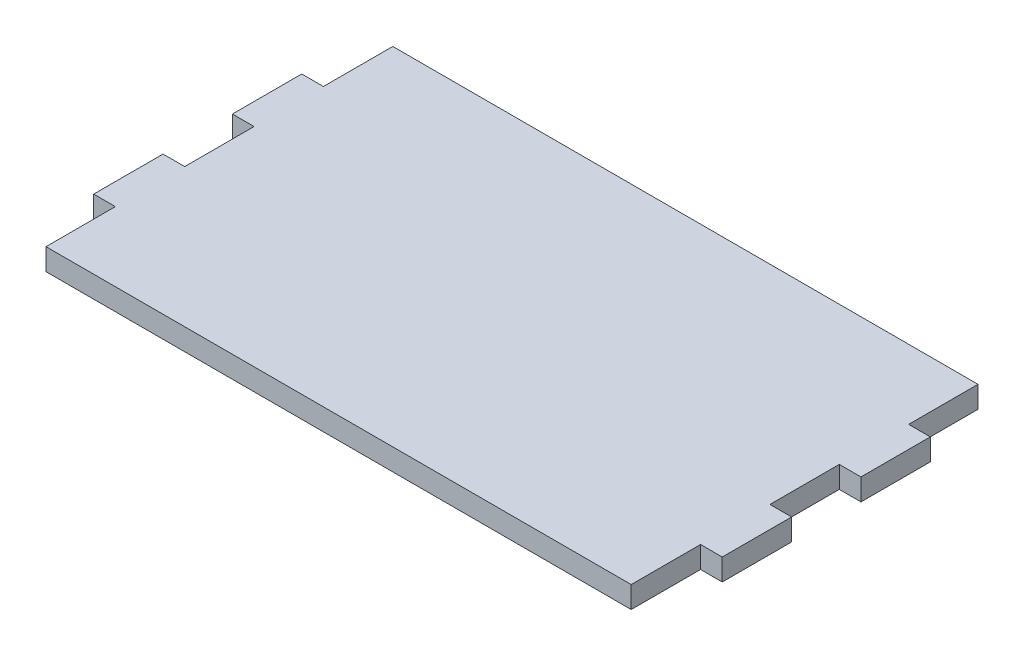
ISO-10303-21;
HEADER;
FILE_DESCRIPTION(('STEP AP214'),'2;1');
FILE_NAME('part.step','',(''),(''),'','','');
FILE_SCHEMA(('AUTOMOTIVE_DESIGN { 1 0 10303 214 1 1 1 1 }'));
ENDSEC;
DATA;
#1=APPLICATION_CONTEXT('core data for automotive mechanical design processes');
#2=APPLICATION_PROTOCOL_DEFINITION('international standard','automotive_design',2000,#1);
#3=PRODUCT_CONTEXT('',#1,'mechanical');
#4=PRODUCT('Part','Part','',(#3));
#5=PRODUCT_RELATED_PRODUCT_CATEGORY('part','',(#4));
#6=PRODUCT_DEFINITION_FORMATION('','',#4);
#7=PRODUCT_DEFINITION_CONTEXT('part definition',#1,'design');
#8=PRODUCT_DEFINITION('design','',#6,#7);
#9=PRODUCT_DEFINITION_SHAPE('','',#8);
#10=(LENGTH_UNIT() NAMED_UNIT(*) SI_UNIT(.MILLI.,.METRE.));
#11=(NAMED_UNIT(*) PLANE_ANGLE_UNIT() SI_UNIT($,.RADIAN.));
#12=(NAMED_UNIT(*) SI_UNIT($,.STERADIAN.) SOLID_ANGLE_UNIT());
#13=UNCERTAINTY_MEASURE_WITH_UNIT(LENGTH_MEASURE(1.E-05),#10,'distance_accuracy_value','');
#14=(GEOMETRIC_REPRESENTATION_CONTEXT(3) GLOBAL_UNCERTAINTY_ASSIGNED_CONTEXT((#13)) GLOBAL_UNIT_ASSIGNED_CONTEXT((#10,
#11,#12)) REPRESENTATION_CONTEXT('',''));
#15=CARTESIAN_POINT('',(0.,0.,0.));
#16=DIRECTION('',(0.,0.,1.));
#17=DIRECTION('',(1.,0.,0.));
#18=AXIS2_PLACEMENT_3D('',#15,#16,#17);
#19=CARTESIAN_POINT('',(-67.5,5.,-40.));
#20=DIRECTION('',(0.,0.,1.));
#21=DIRECTION('',(1.,0.,0.));
#22=AXIS2_PLACEMENT_3D('',#19,#20,#21);
#23=PLANE('',#22);
#24=DIRECTION('',(-1.,0.,0.));
#25=VECTOR('',#24,1.);
#26=CARTESIAN_POINT('',(-67.5,0.,-40.));
#27=LINE('',#26,#25);
#28=CARTESIAN_POINT('',(67.5,0.,-40.));
#29=VERTEX_POINT('',#28);
#30=CARTESIAN_POINT('',(-67.5,0.,-40.));
#31=VERTEX_POINT('',#30);
#32=EDGE_CURVE('E203',#29,#31,#27,.T.);
#33=ORIENTED_EDGE('',*,*,#32,.T.);
#34=DIRECTION('',(0.,-1.,0.));
#35=VECTOR('',#34,1.);
#36=CARTESIAN_POINT('',(-67.5,5.,-40.));
#37=LINE('',#36,#35);
#38=CARTESIAN_POINT('',(-67.5,5.,-40.));
#39=VERTEX_POINT('',#38);
#40=EDGE_CURVE('E11',#39,#31,#37,.T.);
#41=ORIENTED_EDGE('',*,*,#40,.F.);
#42=DIRECTION('',(-1.,0.,0.));
#43=VECTOR('',#42,1.);
#44=CARTESIAN_POINT('',(-67.5,5.,-40.));
#45=LINE('',#44,#43);
#46=CARTESIAN_POINT('',(67.5,5.,-40.));
#47=VERTEX_POINT('',#46);
#48=EDGE_CURVE('E241',#47,#39,#45,.T.);
#49=ORIENTED_EDGE('',*,*,#48,.F.);
#50=DIRECTION('',(0.,-1.,0.));
#51=VECTOR('',#50,1.);
#52=CARTESIAN_POINT('',(67.5,5.,-40.));
#53=LINE('',#52,#51);
#54=EDGE_CURVE('E199',#47,#29,#53,.T.);
#55=ORIENTED_EDGE('',*,*,#54,.T.);
#56=EDGE_LOOP('',(#33,#41,#49,#55));
#57=FACE_BOUND('',#56,.T.);
#58=ADVANCED_FACE('F35',(#57),#23,.F.);
#59=CARTESIAN_POINT('',(-67.5,5.,-40.));
#60=DIRECTION('',(1.,0.,0.));
#61=DIRECTION('',(0.,0.,-1.));
#62=AXIS2_PLACEMENT_3D('',#59,#60,#61);
#63=PLANE('',#62);
#64=DIRECTION('',(0.,0.,1.));
#65=VECTOR('',#64,1.);
#66=CARTESIAN_POINT('',(-67.5,0.,-40.));
#67=LINE('',#66,#65);
#68=CARTESIAN_POINT('',(-67.5,0.,-24.));
#69=VERTEX_POINT('',#68);
#70=EDGE_CURVE('E206',#31,#69,#67,.T.);
#71=ORIENTED_EDGE('',*,*,#70,.T.);
#72=DIRECTION('',(0.,-1.,0.));
#73=VECTOR('',#72,1.);
#74=CARTESIAN_POINT('',(-67.5,5.,-24.));
#75=LINE('',#74,#73);
#76=CARTESIAN_POINT('',(-67.5,5.,-24.));
#77=VERTEX_POINT('',#76);
#78=EDGE_CURVE('E43',#77,#69,#75,.T.);
#79=ORIENTED_EDGE('',*,*,#78,.F.);
#80=DIRECTION('',(0.,0.,1.));
#81=VECTOR('',#80,1.);
#82=CARTESIAN_POINT('',(-67.5,5.,-40.));
#83=LINE('',#82,#81);
#84=EDGE_CURVE('E130',#39,#77,#83,.T.);
#85=ORIENTED_EDGE('',*,*,#84,.F.);
#86=ORIENTED_EDGE('',*,*,#40,.T.);
#87=EDGE_LOOP('',(#71,#79,#85,#86));
#88=FACE_BOUND('',#87,.T.);
#89=ADVANCED_FACE('F359',(#88),#63,.F.);
#90=CARTESIAN_POINT('',(-72.5,5.,-24.));
#91=DIRECTION('',(0.,0.,1.));
#92=DIRECTION('',(1.,0.,0.));
#93=AXIS2_PLACEMENT_3D('',#90,#91,#92);
#94=PLANE('',#93);
#95=DIRECTION('',(-1.,0.,0.));
#96=VECTOR('',#95,1.);
#97=CARTESIAN_POINT('',(-72.5,0.,-24.));
#98=LINE('',#97,#96);
#99=CARTESIAN_POINT('',(-72.5,0.,-24.));
#100=VERTEX_POINT('',#99);
#101=EDGE_CURVE('E208',#69,#100,#98,.T.);
#102=ORIENTED_EDGE('',*,*,#101,.T.);
#103=DIRECTION('',(0.,-1.,0.));
#104=VECTOR('',#103,1.);
#105=CARTESIAN_POINT('',(-72.5,5.,-24.));
#106=LINE('',#105,#104);
#107=CARTESIAN_POINT('',(-72.5,5.,-24.));
#108=VERTEX_POINT('',#107);
#109=EDGE_CURVE('E284',#108,#100,#106,.T.);
#110=ORIENTED_EDGE('',*,*,#109,.F.);
#111=DIRECTION('',(-1.,0.,0.));
#112=VECTOR('',#111,1.);
#113=CARTESIAN_POINT('',(-72.5,5.,-24.));
#114=LINE('',#113,#112);
#115=EDGE_CURVE('E292',#77,#108,#114,.T.);
#116=ORIENTED_EDGE('',*,*,#115,.F.);
#117=ORIENTED_EDGE('',*,*,#78,.T.);
#118=EDGE_LOOP('',(#102,#110,#116,#117));
#119=FACE_BOUND('',#118,.T.);
#120=ADVANCED_FACE('F290',(#119),#94,.F.);
#121=CARTESIAN_POINT('',(-72.5,5.,-24.));
#122=DIRECTION('',(1.,0.,0.));
#123=DIRECTION('',(0.,0.,-1.));
#124=AXIS2_PLACEMENT_3D('',#121,#122,#123);
#125=PLANE('',#124);
#126=DIRECTION('',(0.,0.,1.));
#127=VECTOR('',#126,1.);
#128=CARTESIAN_POINT('',(-72.5,0.,-24.));
#129=LINE('',#128,#127);
#130=CARTESIAN_POINT('',(-72.5,0.,-8.));
#131=VERTEX_POINT('',#130);
#132=EDGE_CURVE('E210',#100,#131,#129,.T.);
#133=ORIENTED_EDGE('',*,*,#132,.T.);
#134=DIRECTION('',(0.,-1.,0.));
#135=VECTOR('',#134,1.);
#136=CARTESIAN_POINT('',(-72.5,5.,-8.));
#137=LINE('',#136,#135);
#138=CARTESIAN_POINT('',(-72.5,5.,-8.));
#139=VERTEX_POINT('',#138);
#140=EDGE_CURVE('E281',#139,#131,#137,.T.);
#141=ORIENTED_EDGE('',*,*,#140,.F.);
#142=DIRECTION('',(0.,0.,1.));
#143=VECTOR('',#142,1.);
#144=CARTESIAN_POINT('',(-72.5,5.,-24.));
#145=LINE('',#144,#143);
#146=EDGE_CURVE('E310',#108,#139,#145,.T.);
#147=ORIENTED_EDGE('',*,*,#146,.F.);
#148=ORIENTED_EDGE('',*,*,#109,.T.);
#149=EDGE_LOOP('',(#133,#141,#147,#148));
#150=FACE_BOUND('',#149,.T.);
#151=ADVANCED_FACE('F301',(#150),#125,.F.);
#152=CARTESIAN_POINT('',(-72.5,5.,-8.));
#153=DIRECTION('',(0.,0.,-1.));
#154=DIRECTION('',(-1.,0.,0.));
#155=AXIS2_PLACEMENT_3D('',#152,#153,#154);
#156=PLANE('',#155);
#157=DIRECTION('',(1.,0.,0.));
#158=VECTOR('',#157,1.);
#159=CARTESIAN_POINT('',(-72.5,0.,-8.));
#160=LINE('',#159,#158);
#161=CARTESIAN_POINT('',(-67.5,0.,-8.));
#162=VERTEX_POINT('',#161);
#163=EDGE_CURVE('E212',#131,#162,#160,.T.);
#164=ORIENTED_EDGE('',*,*,#163,.T.);
#165=DIRECTION('',(0.,-1.,0.));
#166=VECTOR('',#165,1.);
#167=CARTESIAN_POINT('',(-67.5,5.,-8.));
#168=LINE('',#167,#166);
#169=CARTESIAN_POINT('',(-67.5,5.,-8.));
#170=VERTEX_POINT('',#169);
#171=EDGE_CURVE('E278',#170,#162,#168,.T.);
#172=ORIENTED_EDGE('',*,*,#171,.F.);
#173=DIRECTION('',(1.,0.,0.));
#174=VECTOR('',#173,1.);
#175=CARTESIAN_POINT('',(-72.5,5.,-8.));
#176=LINE('',#175,#174);
#177=EDGE_CURVE('E307',#139,#170,#176,.T.);
#178=ORIENTED_EDGE('',*,*,#177,.F.);
#179=ORIENTED_EDGE('',*,*,#140,.T.);
#180=EDGE_LOOP('',(#164,#172,#178,#179));
#181=FACE_BOUND('',#180,.T.);
#182=ADVANCED_FACE('F305',(#181),#156,.F.);
#183=CARTESIAN_POINT('',(-67.5,5.,-8.));
#184=DIRECTION('',(1.,0.,0.));
#185=DIRECTION('',(0.,0.,-1.));
#186=AXIS2_PLACEMENT_3D('',#183,#184,#185);
#187=PLANE('',#186);
#188=DIRECTION('',(0.,0.,1.));
#189=VECTOR('',#188,1.);
#190=CARTESIAN_POINT('',(-67.5,0.,-8.));
#191=LINE('',#190,#189);
#192=CARTESIAN_POINT('',(-67.5,0.,7.99999999999999));
#193=VERTEX_POINT('',#192);
#194=EDGE_CURVE('E214',#162,#193,#191,.T.);
#195=ORIENTED_EDGE('',*,*,#194,.T.);
#196=DIRECTION('',(0.,-1.,0.));
#197=VECTOR('',#196,1.);
#198=CARTESIAN_POINT('',(-67.5,5.,7.99999999999999));
#199=LINE('',#198,#197);
#200=CARTESIAN_POINT('',(-67.5,5.,7.99999999999999));
#201=VERTEX_POINT('',#200);
#202=EDGE_CURVE('E275',#201,#193,#199,.T.);
#203=ORIENTED_EDGE('',*,*,#202,.F.);
#204=DIRECTION('',(0.,0.,1.));
#205=VECTOR('',#204,1.);
#206=CARTESIAN_POINT('',(-67.5,5.,-8.));
#207=LINE('',#206,#205);
#208=EDGE_CURVE('E309',#170,#201,#207,.T.);
#209=ORIENTED_EDGE('',*,*,#208,.F.);
#210=ORIENTED_EDGE('',*,*,#171,.T.);
#211=EDGE_LOOP('',(#195,#203,#209,#210));
#212=FACE_BOUND('',#211,.T.);
#213=ADVANCED_FACE('F372',(#212),#187,.F.);
#214=CARTESIAN_POINT('',(-72.5,5.,7.99999999999999));
#215=DIRECTION('',(0.,0.,1.));
#216=DIRECTION('',(1.,0.,0.));
#217=AXIS2_PLACEMENT_3D('',#214,#215,#216);
#218=PLANE('',#217);
#219=DIRECTION('',(-1.,0.,0.));
#220=VECTOR('',#219,1.);
#221=CARTESIAN_POINT('',(-72.5,0.,7.99999999999999));
#222=LINE('',#221,#220);
#223=CARTESIAN_POINT('',(-72.5,0.,7.99999999999999));
#224=VERTEX_POINT('',#223);
#225=EDGE_CURVE('E216',#193,#224,#222,.T.);
#226=ORIENTED_EDGE('',*,*,#225,.T.);
#227=DIRECTION('',(0.,-1.,0.));
#228=VECTOR('',#227,1.);
#229=CARTESIAN_POINT('',(-72.5,5.,7.99999999999999));
#230=LINE('',#229,#228);
#231=CARTESIAN_POINT('',(-72.5,5.,7.99999999999999));
#232=VERTEX_POINT('',#231);
#233=EDGE_CURVE('E272',#232,#224,#230,.T.);
#234=ORIENTED_EDGE('',*,*,#233,.F.);
#235=DIRECTION('',(-1.,0.,0.));
#236=VECTOR('',#235,1.);
#237=CARTESIAN_POINT('',(-72.5,5.,7.99999999999999));
#238=LINE('',#237,#236);
#239=EDGE_CURVE('E312',#201,#232,#238,.T.);
#240=ORIENTED_EDGE('',*,*,#239,.F.);
#241=ORIENTED_EDGE('',*,*,#202,.T.);
#242=EDGE_LOOP('',(#226,#234,#240,#241));
#243=FACE_BOUND('',#242,.T.);
#244=ADVANCED_FACE('F375',(#243),#218,.F.);
#245=CARTESIAN_POINT('',(-72.5,5.,7.99999999999999));
#246=DIRECTION('',(1.,0.,0.));
#247=DIRECTION('',(0.,0.,-1.));
#248=AXIS2_PLACEMENT_3D('',#245,#246,#247);
#249=PLANE('',#248);
#250=DIRECTION('',(0.,0.,1.));
#251=VECTOR('',#250,1.);
#252=CARTESIAN_POINT('',(-72.5,0.,7.99999999999999));
#253=LINE('',#252,#251);
#254=CARTESIAN_POINT('',(-72.5,0.,24.));
#255=VERTEX_POINT('',#254);
#256=EDGE_CURVE('E218',#224,#255,#253,.T.);
#257=ORIENTED_EDGE('',*,*,#256,.T.);
#258=DIRECTION('',(0.,-1.,0.));
#259=VECTOR('',#258,1.);
#260=CARTESIAN_POINT('',(-72.5,5.,24.));
#261=LINE('',#260,#259);
#262=CARTESIAN_POINT('',(-72.5,5.,24.));
#263=VERTEX_POINT('',#262);
#264=EDGE_CURVE('E269',#263,#255,#261,.T.);
#265=ORIENTED_EDGE('',*,*,#264,.F.);
#266=DIRECTION('',(0.,0.,1.));
#267=VECTOR('',#266,1.);
#268=CARTESIAN_POINT('',(-72.5,5.,7.99999999999999));
#269=LINE('',#268,#267);
#270=EDGE_CURVE('E318',#232,#263,#269,.T.);
#271=ORIENTED_EDGE('',*,*,#270,.F.);
#272=ORIENTED_EDGE('',*,*,#233,.T.);
#273=EDGE_LOOP('',(#257,#265,#271,#272));
#274=FACE_BOUND('',#273,.T.);
#275=ADVANCED_FACE('F379',(#274),#249,.F.);
#276=CARTESIAN_POINT('',(-72.5,5.,24.));
#277=DIRECTION('',(0.,0.,-1.));
#278=DIRECTION('',(-1.,0.,0.));
#279=AXIS2_PLACEMENT_3D('',#276,#277,#278);
#280=PLANE('',#279);
#281=DIRECTION('',(1.,0.,0.));
#282=VECTOR('',#281,1.);
#283=CARTESIAN_POINT('',(-72.5,0.,24.));
#284=LINE('',#283,#282);
#285=CARTESIAN_POINT('',(-67.5,0.,24.));
#286=VERTEX_POINT('',#285);
#287=EDGE_CURVE('E220',#255,#286,#284,.T.);
#288=ORIENTED_EDGE('',*,*,#287,.T.);
#289=DIRECTION('',(0.,-1.,0.));
#290=VECTOR('',#289,1.);
#291=CARTESIAN_POINT('',(-67.5,5.,24.));
#292=LINE('',#291,#290);
#293=CARTESIAN_POINT('',(-67.5,5.,24.));
#294=VERTEX_POINT('',#293);
#295=EDGE_CURVE('E266',#294,#286,#292,.T.);
#296=ORIENTED_EDGE('',*,*,#295,.F.);
#297=DIRECTION('',(1.,0.,0.));
#298=VECTOR('',#297,1.);
#299=CARTESIAN_POINT('',(-72.5,5.,24.));
#300=LINE('',#299,#298);
#301=EDGE_CURVE('E320',#263,#294,#300,.T.);
#302=ORIENTED_EDGE('',*,*,#301,.F.);
#303=ORIENTED_EDGE('',*,*,#264,.T.);
#304=EDGE_LOOP('',(#288,#296,#302,#303));
#305=FACE_BOUND('',#304,.T.);
#306=ADVANCED_FACE('F383',(#305),#280,.F.);
#307=CARTESIAN_POINT('',(-67.5,5.,24.));
#308=DIRECTION('',(1.,0.,0.));
#309=DIRECTION('',(0.,0.,-1.));
#310=AXIS2_PLACEMENT_3D('',#307,#308,#309);
#311=PLANE('',#310);
#312=DIRECTION('',(0.,0.,1.));
#313=VECTOR('',#312,1.);
#314=CARTESIAN_POINT('',(-67.5,0.,24.));
#315=LINE('',#314,#313);
#316=CARTESIAN_POINT('',(-67.5,0.,40.));
#317=VERTEX_POINT('',#316);
#318=EDGE_CURVE('E222',#286,#317,#315,.T.);
#319=ORIENTED_EDGE('',*,*,#318,.T.);
#320=DIRECTION('',(0.,-1.,0.));
#321=VECTOR('',#320,1.);
#322=CARTESIAN_POINT('',(-67.5,5.,40.));
#323=LINE('',#322,#321);
#324=CARTESIAN_POINT('',(-67.5,5.,40.));
#325=VERTEX_POINT('',#324);
#326=EDGE_CURVE('E263',#325,#317,#323,.T.);
#327=ORIENTED_EDGE('',*,*,#326,.F.);
#328=DIRECTION('',(0.,0.,1.));
#329=VECTOR('',#328,1.);
#330=CARTESIAN_POINT('',(-67.5,5.,24.));
#331=LINE('',#330,#329);
#332=EDGE_CURVE('E322',#294,#325,#331,.T.);
#333=ORIENTED_EDGE('',*,*,#332,.F.);
#334=ORIENTED_EDGE('',*,*,#295,.T.);
#335=EDGE_LOOP('',(#319,#327,#333,#334));
#336=FACE_BOUND('',#335,.T.);
#337=ADVANCED_FACE('F387',(#336),#311,.F.);
#338=CARTESIAN_POINT('',(-67.5,5.,40.));
#339=DIRECTION('',(0.,0.,-1.));
#340=DIRECTION('',(-1.,0.,0.));
#341=AXIS2_PLACEMENT_3D('',#338,#339,#340);
#342=PLANE('',#341);
#343=DIRECTION('',(1.,0.,0.));
#344=VECTOR('',#343,1.);
#345=CARTESIAN_POINT('',(-67.5,0.,40.));
#346=LINE('',#345,#344);
#347=CARTESIAN_POINT('',(67.5,0.,40.));
#348=VERTEX_POINT('',#347);
#349=EDGE_CURVE('E224',#317,#348,#346,.T.);
#350=ORIENTED_EDGE('',*,*,#349,.T.);
#351=DIRECTION('',(0.,-1.,0.));
#352=VECTOR('',#351,1.);
#353=CARTESIAN_POINT('',(67.5,5.,40.));
#354=LINE('',#353,#352);
#355=CARTESIAN_POINT('',(67.5,5.,40.));
#356=VERTEX_POINT('',#355);
#357=EDGE_CURVE('E260',#356,#348,#354,.T.);
#358=ORIENTED_EDGE('',*,*,#357,.F.);
#359=DIRECTION('',(1.,0.,0.));
#360=VECTOR('',#359,1.);
#361=CARTESIAN_POINT('',(-67.5,5.,40.));
#362=LINE('',#361,#360);
#363=EDGE_CURVE('E324',#325,#356,#362,.T.);
#364=ORIENTED_EDGE('',*,*,#363,.F.);
#365=ORIENTED_EDGE('',*,*,#326,.T.);
#366=EDGE_LOOP('',(#350,#358,#364,#365));
#367=FACE_BOUND('',#366,.T.);
#368=ADVANCED_FACE('F391',(#367),#342,.F.);
#369=CARTESIAN_POINT('',(67.5,5.,24.));
#370=DIRECTION('',(-1.,0.,0.));
#371=DIRECTION('',(0.,0.,1.));
#372=AXIS2_PLACEMENT_3D('',#369,#370,#371);
#373=PLANE('',#372);
#374=DIRECTION('',(0.,0.,-1.));
#375=VECTOR('',#374,1.);
#376=CARTESIAN_POINT('',(67.5,0.,24.));
#377=LINE('',#376,#375);
#378=CARTESIAN_POINT('',(67.5,0.,24.));
#379=VERTEX_POINT('',#378);
#380=EDGE_CURVE('E226',#348,#379,#377,.T.);
#381=ORIENTED_EDGE('',*,*,#380,.T.);
#382=DIRECTION('',(0.,-1.,0.));
#383=VECTOR('',#382,1.);
#384=CARTESIAN_POINT('',(67.5,5.,24.));
#385=LINE('',#384,#383);
#386=CARTESIAN_POINT('',(67.5,5.,24.));
#387=VERTEX_POINT('',#386);
#388=EDGE_CURVE('E257',#387,#379,#385,.T.);
#389=ORIENTED_EDGE('',*,*,#388,.F.);
#390=DIRECTION('',(0.,0.,-1.));
#391=VECTOR('',#390,1.);
#392=CARTESIAN_POINT('',(67.5,5.,24.));
#393=LINE('',#392,#391);
#394=EDGE_CURVE('E326',#356,#387,#393,.T.);
#395=ORIENTED_EDGE('',*,*,#394,.F.);
#396=ORIENTED_EDGE('',*,*,#357,.T.);
#397=EDGE_LOOP('',(#381,#389,#395,#396));
#398=FACE_BOUND('',#397,.T.);
#399=ADVANCED_FACE('F395',(#398),#373,.F.);
#400=CARTESIAN_POINT('',(67.5,5.,24.));
#401=DIRECTION('',(0.,0.,-1.));
#402=DIRECTION('',(-1.,0.,0.));
#403=AXIS2_PLACEMENT_3D('',#400,#401,#402);
#404=PLANE('',#403);
#405=DIRECTION('',(1.,0.,0.));
#406=VECTOR('',#405,1.);
#407=CARTESIAN_POINT('',(67.5,0.,24.));
#408=LINE('',#407,#406);
#409=CARTESIAN_POINT('',(72.5,0.,24.));
#410=VERTEX_POINT('',#409);
#411=EDGE_CURVE('E228',#379,#410,#408,.T.);
#412=ORIENTED_EDGE('',*,*,#411,.T.);
#413=DIRECTION('',(0.,-1.,0.));
#414=VECTOR('',#413,1.);
#415=CARTESIAN_POINT('',(72.5,5.,24.));
#416=LINE('',#415,#414);
#417=CARTESIAN_POINT('',(72.5,5.,24.));
#418=VERTEX_POINT('',#417);
#419=EDGE_CURVE('E254',#418,#410,#416,.T.);
#420=ORIENTED_EDGE('',*,*,#419,.F.);
#421=DIRECTION('',(1.,0.,0.));
#422=VECTOR('',#421,1.);
#423=CARTESIAN_POINT('',(67.5,5.,24.));
#424=LINE('',#423,#422);
#425=EDGE_CURVE('E328',#387,#418,#424,.T.);
#426=ORIENTED_EDGE('',*,*,#425,.F.);
#427=ORIENTED_EDGE('',*,*,#388,.T.);
#428=EDGE_LOOP('',(#412,#420,#426,#427));
#429=FACE_BOUND('',#428,.T.);
#430=ADVANCED_FACE('F399',(#429),#404,.F.);
#431=CARTESIAN_POINT('',(72.5,5.,7.99999999999999));
#432=DIRECTION('',(-1.,0.,0.));
#433=DIRECTION('',(0.,0.,1.));
#434=AXIS2_PLACEMENT_3D('',#431,#432,#433);
#435=PLANE('',#434);
#436=DIRECTION('',(0.,0.,-1.));
#437=VECTOR('',#436,1.);
#438=CARTESIAN_POINT('',(72.5,0.,7.99999999999999));
#439=LINE('',#438,#437);
#440=CARTESIAN_POINT('',(72.5,0.,7.99999999999999));
#441=VERTEX_POINT('',#440);
#442=EDGE_CURVE('E230',#410,#441,#439,.T.);
#443=ORIENTED_EDGE('',*,*,#442,.T.);
#444=DIRECTION('',(0.,-1.,0.));
#445=VECTOR('',#444,1.);
#446=CARTESIAN_POINT('',(72.5,5.,7.99999999999999));
#447=LINE('',#446,#445);
#448=CARTESIAN_POINT('',(72.5,5.,7.99999999999999));
#449=VERTEX_POINT('',#448);
#450=EDGE_CURVE('E251',#449,#441,#447,.T.);
#451=ORIENTED_EDGE('',*,*,#450,.F.);
#452=DIRECTION('',(0.,0.,-1.));
#453=VECTOR('',#452,1.);
#454=CARTESIAN_POINT('',(72.5,5.,7.99999999999999));
#455=LINE('',#454,#453);
#456=EDGE_CURVE('E330',#418,#449,#455,.T.);
#457=ORIENTED_EDGE('',*,*,#456,.F.);
#458=ORIENTED_EDGE('',*,*,#419,.T.);
#459=EDGE_LOOP('',(#443,#451,#457,#458));
#460=FACE_BOUND('',#459,.T.);
#461=ADVANCED_FACE('F403',(#460),#435,.F.);
#462=CARTESIAN_POINT('',(67.5,5.,7.99999999999999));
#463=DIRECTION('',(0.,0.,1.));
#464=DIRECTION('',(1.,0.,0.));
#465=AXIS2_PLACEMENT_3D('',#462,#463,#464);
#466=PLANE('',#465);
#467=DIRECTION('',(-1.,0.,0.));
#468=VECTOR('',#467,1.);
#469=CARTESIAN_POINT('',(67.5,0.,7.99999999999999));
#470=LINE('',#469,#468);
#471=CARTESIAN_POINT('',(67.5,0.,7.99999999999999));
#472=VERTEX_POINT('',#471);
#473=EDGE_CURVE('E232',#441,#472,#470,.T.);
#474=ORIENTED_EDGE('',*,*,#473,.T.);
#475=DIRECTION('',(0.,-1.,0.));
#476=VECTOR('',#475,1.);
#477=CARTESIAN_POINT('',(67.5,5.,7.99999999999999));
#478=LINE('',#477,#476);
#479=CARTESIAN_POINT('',(67.5,5.,7.99999999999999));
#480=VERTEX_POINT('',#479);
#481=EDGE_CURVE('E248',#480,#472,#478,.T.);
#482=ORIENTED_EDGE('',*,*,#481,.F.);
#483=DIRECTION('',(-1.,0.,0.));
#484=VECTOR('',#483,1.);
#485=CARTESIAN_POINT('',(67.5,5.,7.99999999999999));
#486=LINE('',#485,#484);
#487=EDGE_CURVE('E332',#449,#480,#486,.T.);
#488=ORIENTED_EDGE('',*,*,#487,.F.);
#489=ORIENTED_EDGE('',*,*,#450,.T.);
#490=EDGE_LOOP('',(#474,#482,#488,#489));
#491=FACE_BOUND('',#490,.T.);
#492=ADVANCED_FACE('F407',(#491),#466,.F.);
#493=CARTESIAN_POINT('',(67.5,5.,-8.00000000000001));
#494=DIRECTION('',(-1.,0.,0.));
#495=DIRECTION('',(0.,0.,1.));
#496=AXIS2_PLACEMENT_3D('',#493,#494,#495);
#497=PLANE('',#496);
#498=DIRECTION('',(0.,0.,-1.));
#499=VECTOR('',#498,1.);
#500=CARTESIAN_POINT('',(67.5,0.,-8.00000000000001));
#501=LINE('',#500,#499);
#502=CARTESIAN_POINT('',(67.5,0.,-8.00000000000001));
#503=VERTEX_POINT('',#502);
#504=EDGE_CURVE('E234',#472,#503,#501,.T.);
#505=ORIENTED_EDGE('',*,*,#504,.T.);
#506=DIRECTION('',(0.,-1.,0.));
#507=VECTOR('',#506,1.);
#508=CARTESIAN_POINT('',(67.5,5.,-8.00000000000001));
#509=LINE('',#508,#507);
#510=CARTESIAN_POINT('',(67.5,5.,-8.00000000000001));
#511=VERTEX_POINT('',#510);
#512=EDGE_CURVE('E245',#511,#503,#509,.T.);
#513=ORIENTED_EDGE('',*,*,#512,.F.);
#514=DIRECTION('',(0.,0.,-1.));
#515=VECTOR('',#514,1.);
#516=CARTESIAN_POINT('',(67.5,5.,-8.00000000000001));
#517=LINE('',#516,#515);
#518=EDGE_CURVE('E334',#480,#511,#517,.T.);
#519=ORIENTED_EDGE('',*,*,#518,.F.);
#520=ORIENTED_EDGE('',*,*,#481,.T.);
#521=EDGE_LOOP('',(#505,#513,#519,#520));
#522=FACE_BOUND('',#521,.T.);
#523=ADVANCED_FACE('F340',(#522),#497,.F.);
#524=CARTESIAN_POINT('',(67.5,5.,-8.00000000000001));
#525=DIRECTION('',(0.,0.,-1.));
#526=DIRECTION('',(-1.,0.,0.));
#527=AXIS2_PLACEMENT_3D('',#524,#525,#526);
#528=PLANE('',#527);
#529=DIRECTION('',(1.,0.,0.));
#530=VECTOR('',#529,1.);
#531=CARTESIAN_POINT('',(67.5,0.,-8.00000000000001));
#532=LINE('',#531,#530);
#533=CARTESIAN_POINT('',(72.5,0.,-8.00000000000001));
#534=VERTEX_POINT('',#533);
#535=EDGE_CURVE('E236',#503,#534,#532,.T.);
#536=ORIENTED_EDGE('',*,*,#535,.T.);
#537=DIRECTION('',(0.,-1.,0.));
#538=VECTOR('',#537,1.);
#539=CARTESIAN_POINT('',(72.5,5.,-8.00000000000001));
#540=LINE('',#539,#538);
#541=CARTESIAN_POINT('',(72.5,5.,-8.00000000000001));
#542=VERTEX_POINT('',#541);
#543=EDGE_CURVE('E194',#542,#534,#540,.T.);
#544=ORIENTED_EDGE('',*,*,#543,.F.);
#545=DIRECTION('',(1.,0.,0.));
#546=VECTOR('',#545,1.);
#547=CARTESIAN_POINT('',(67.5,5.,-8.00000000000001));
#548=LINE('',#547,#546);
#549=EDGE_CURVE('E185',#511,#542,#548,.T.);
#550=ORIENTED_EDGE('',*,*,#549,.F.);
#551=ORIENTED_EDGE('',*,*,#512,.T.);
#552=EDGE_LOOP('',(#536,#544,#550,#551));
#553=FACE_BOUND('',#552,.T.);
#554=ADVANCED_FACE('F344',(#553),#528,.F.);
#555=CARTESIAN_POINT('',(72.5,5.,-24.));
#556=DIRECTION('',(-1.,0.,0.));
#557=DIRECTION('',(0.,0.,1.));
#558=AXIS2_PLACEMENT_3D('',#555,#556,#557);
#559=PLANE('',#558);
#560=DIRECTION('',(0.,0.,-1.));
#561=VECTOR('',#560,1.);
#562=CARTESIAN_POINT('',(72.5,0.,-24.));
#563=LINE('',#562,#561);
#564=CARTESIAN_POINT('',(72.5,0.,-24.));
#565=VERTEX_POINT('',#564);
#566=EDGE_CURVE('E193',#534,#565,#563,.T.);
#567=ORIENTED_EDGE('',*,*,#566,.T.);
#568=DIRECTION('',(0.,-1.,0.));
#569=VECTOR('',#568,1.);
#570=CARTESIAN_POINT('',(72.5,5.,-24.));
#571=LINE('',#570,#569);
#572=CARTESIAN_POINT('',(72.5,5.,-24.));
#573=VERTEX_POINT('',#572);
#574=EDGE_CURVE('E190',#573,#565,#571,.T.);
#575=ORIENTED_EDGE('',*,*,#574,.F.);
#576=DIRECTION('',(0.,0.,-1.));
#577=VECTOR('',#576,1.);
#578=CARTESIAN_POINT('',(72.5,5.,-24.));
#579=LINE('',#578,#577);
#580=EDGE_CURVE('E179',#542,#573,#579,.T.);
#581=ORIENTED_EDGE('',*,*,#580,.F.);
#582=ORIENTED_EDGE('',*,*,#543,.T.);
#583=EDGE_LOOP('',(#567,#575,#581,#582));
#584=FACE_BOUND('',#583,.T.);
#585=ADVANCED_FACE('F191',(#584),#559,.F.);
#586=CARTESIAN_POINT('',(67.5,5.,-24.));
#587=DIRECTION('',(0.,0.,1.));
#588=DIRECTION('',(1.,0.,0.));
#589=AXIS2_PLACEMENT_3D('',#586,#587,#588);
#590=PLANE('',#589);
#591=DIRECTION('',(-1.,0.,0.));
#592=VECTOR('',#591,1.);
#593=CARTESIAN_POINT('',(67.5,0.,-24.));
#594=LINE('',#593,#592);
#595=CARTESIAN_POINT('',(67.5,0.,-24.));
#596=VERTEX_POINT('',#595);
#597=EDGE_CURVE('E116',#565,#596,#594,.T.);
#598=ORIENTED_EDGE('',*,*,#597,.T.);
#599=DIRECTION('',(0.,-1.,0.));
#600=VECTOR('',#599,1.);
#601=CARTESIAN_POINT('',(67.5,5.,-24.));
#602=LINE('',#601,#600);
#603=CARTESIAN_POINT('',(67.5,5.,-24.));
#604=VERTEX_POINT('',#603);
#605=EDGE_CURVE('E195',#604,#596,#602,.T.);
#606=ORIENTED_EDGE('',*,*,#605,.F.);
#607=DIRECTION('',(-1.,0.,0.));
#608=VECTOR('',#607,1.);
#609=CARTESIAN_POINT('',(67.5,5.,-24.));
#610=LINE('',#609,#608);
#611=EDGE_CURVE('E183',#573,#604,#610,.T.);
#612=ORIENTED_EDGE('',*,*,#611,.F.);
#613=ORIENTED_EDGE('',*,*,#574,.T.);
#614=EDGE_LOOP('',(#598,#606,#612,#613));
#615=FACE_BOUND('',#614,.T.);
#616=ADVANCED_FACE('F197',(#615),#590,.F.);
#617=CARTESIAN_POINT('',(67.5,5.,-40.));
#618=DIRECTION('',(-1.,0.,0.));
#619=DIRECTION('',(0.,0.,1.));
#620=AXIS2_PLACEMENT_3D('',#617,#618,#619);
#621=PLANE('',#620);
#622=DIRECTION('',(0.,0.,-1.));
#623=VECTOR('',#622,1.);
#624=CARTESIAN_POINT('',(67.5,0.,-40.));
#625=LINE('',#624,#623);
#626=EDGE_CURVE('E122',#596,#29,#625,.T.);
#627=ORIENTED_EDGE('',*,*,#626,.T.);
#628=ORIENTED_EDGE('',*,*,#54,.F.);
#629=DIRECTION('',(0.,0.,-1.));
#630=VECTOR('',#629,1.);
#631=CARTESIAN_POINT('',(67.5,5.,-40.));
#632=LINE('',#631,#630);
#633=EDGE_CURVE('E51',#604,#47,#632,.T.);
#634=ORIENTED_EDGE('',*,*,#633,.F.);
#635=ORIENTED_EDGE('',*,*,#605,.T.);
#636=EDGE_LOOP('',(#627,#628,#634,#635));
#637=FACE_BOUND('',#636,.T.);
#638=ADVANCED_FACE('F348',(#637),#621,.F.);
#639=CARTESIAN_POINT('',(0.,5.,0.));
#640=DIRECTION('',(0.,-1.,0.));
#641=DIRECTION('',(0.,0.,-1.));
#642=AXIS2_PLACEMENT_3D('',#639,#640,#641);
#643=PLANE('',#642);
#644=ORIENTED_EDGE('',*,*,#48,.T.);
#645=ORIENTED_EDGE('',*,*,#84,.T.);
#646=ORIENTED_EDGE('',*,*,#115,.T.);
#647=ORIENTED_EDGE('',*,*,#146,.T.);
#648=ORIENTED_EDGE('',*,*,#177,.T.);
#649=ORIENTED_EDGE('',*,*,#208,.T.);
#650=ORIENTED_EDGE('',*,*,#239,.T.);
#651=ORIENTED_EDGE('',*,*,#270,.T.);
#652=ORIENTED_EDGE('',*,*,#301,.T.);
#653=ORIENTED_EDGE('',*,*,#332,.T.);
#654=ORIENTED_EDGE('',*,*,#363,.T.);
#655=ORIENTED_EDGE('',*,*,#394,.T.);
#656=ORIENTED_EDGE('',*,*,#425,.T.);
#657=ORIENTED_EDGE('',*,*,#456,.T.);
#658=ORIENTED_EDGE('',*,*,#487,.T.);
#659=ORIENTED_EDGE('',*,*,#518,.T.);
#660=ORIENTED_EDGE('',*,*,#549,.T.);
#661=ORIENTED_EDGE('',*,*,#580,.T.);
#662=ORIENTED_EDGE('',*,*,#611,.T.);
#663=ORIENTED_EDGE('',*,*,#633,.T.);
#664=EDGE_LOOP('',(#644,#645,#646,#647,#648,#649,#650,#651,#652,#653,#654,#655,#656,#657,#658,
#659,#660,#661,#662,#663));
#665=FACE_BOUND('',#664,.T.);
#666=ADVANCED_FACE('F181',(#665),#643,.F.);
#667=CARTESIAN_POINT('',(0.,0.,0.));
#668=DIRECTION('',(0.,-1.,0.));
#669=DIRECTION('',(0.,0.,-1.));
#670=AXIS2_PLACEMENT_3D('',#667,#668,#669);
#671=PLANE('',#670);
#672=ORIENTED_EDGE('',*,*,#32,.F.);
#673=ORIENTED_EDGE('',*,*,#626,.F.);
#674=ORIENTED_EDGE('',*,*,#597,.F.);
#675=ORIENTED_EDGE('',*,*,#566,.F.);
#676=ORIENTED_EDGE('',*,*,#535,.F.);
#677=ORIENTED_EDGE('',*,*,#504,.F.);
#678=ORIENTED_EDGE('',*,*,#473,.F.);
#679=ORIENTED_EDGE('',*,*,#442,.F.);
#680=ORIENTED_EDGE('',*,*,#411,.F.);
#681=ORIENTED_EDGE('',*,*,#380,.F.);
#682=ORIENTED_EDGE('',*,*,#349,.F.);
#683=ORIENTED_EDGE('',*,*,#318,.F.);
#684=ORIENTED_EDGE('',*,*,#287,.F.);
#685=ORIENTED_EDGE('',*,*,#256,.F.);
#686=ORIENTED_EDGE('',*,*,#225,.F.);
#687=ORIENTED_EDGE('',*,*,#194,.F.);
#688=ORIENTED_EDGE('',*,*,#163,.F.);
#689=ORIENTED_EDGE('',*,*,#132,.F.);
#690=ORIENTED_EDGE('',*,*,#101,.F.);
#691=ORIENTED_EDGE('',*,*,#70,.F.);
#692=EDGE_LOOP('',(#672,#673,#674,#675,#676,#677,#678,#679,#680,#681,#682,#683,#684,#685,#686,
#687,#688,#689,#690,#691));
#693=FACE_BOUND('',#692,.T.);
#694=ADVANCED_FACE('F296',(#693),#671,.T.);
#695=CLOSED_SHELL('',(#58,#89,#120,#151,#182,#213,#244,#275,#306,#337,#368,#399,#430,#461,#492,
#523,#554,#585,#616,#638,#666,#694));
#696=MANIFOLD_SOLID_BREP('B2',#695);
#697=ADVANCED_BREP_SHAPE_REPRESENTATION('',(#18,#696),#14);
#698=SHAPE_DEFINITION_REPRESENTATION(#9,#697);
ENDSEC;
END-ISO-10303-21;
